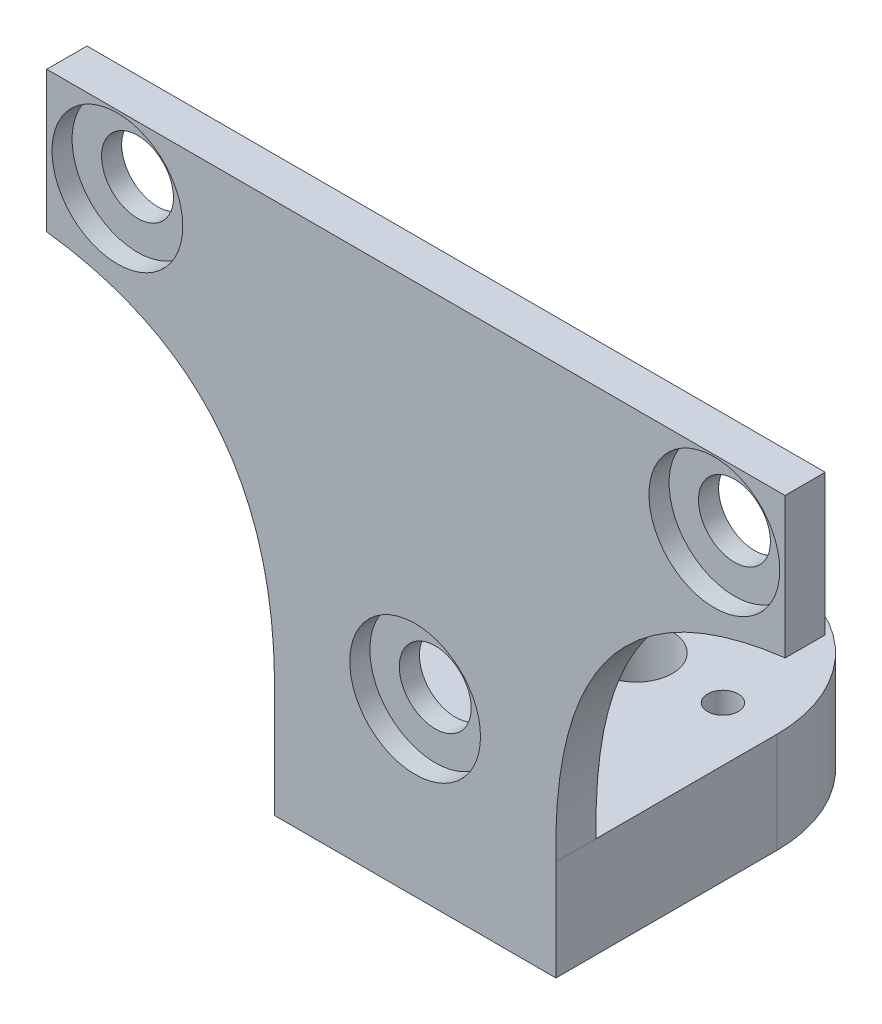
ISO-10303-21;
HEADER;
FILE_DESCRIPTION(('STEP AP214'),'2;1');
FILE_NAME('part.step','',(''),(''),'','','');
FILE_SCHEMA(('AUTOMOTIVE_DESIGN { 1 0 10303 214 1 1 1 1 }'));
ENDSEC;
DATA;
#1=APPLICATION_CONTEXT('core data for automotive mechanical design processes');
#2=APPLICATION_PROTOCOL_DEFINITION('international standard','automotive_design',2000,#1);
#3=PRODUCT_CONTEXT('',#1,'mechanical');
#4=PRODUCT('Part','Part','',(#3));
#5=PRODUCT_RELATED_PRODUCT_CATEGORY('part','',(#4));
#6=PRODUCT_DEFINITION_FORMATION('','',#4);
#7=PRODUCT_DEFINITION_CONTEXT('part definition',#1,'design');
#8=PRODUCT_DEFINITION('design','',#6,#7);
#9=PRODUCT_DEFINITION_SHAPE('','',#8);
#10=(LENGTH_UNIT() NAMED_UNIT(*) SI_UNIT(.MILLI.,.METRE.));
#11=(NAMED_UNIT(*) PLANE_ANGLE_UNIT() SI_UNIT($,.RADIAN.));
#12=(NAMED_UNIT(*) SI_UNIT($,.STERADIAN.) SOLID_ANGLE_UNIT());
#13=UNCERTAINTY_MEASURE_WITH_UNIT(LENGTH_MEASURE(1.E-05),#10,'distance_accuracy_value','');
#14=(GEOMETRIC_REPRESENTATION_CONTEXT(3) GLOBAL_UNCERTAINTY_ASSIGNED_CONTEXT((#13)) GLOBAL_UNIT_ASSIGNED_CONTEXT((#10,
#11,#12)) REPRESENTATION_CONTEXT('',''));
#15=CARTESIAN_POINT('',(0.,0.,0.));
#16=DIRECTION('',(0.,0.,1.));
#17=DIRECTION('',(1.,0.,0.));
#18=AXIS2_PLACEMENT_3D('',#15,#16,#17);
#19=CARTESIAN_POINT('',(36.625,7.025,4.));
#20=DIRECTION('',(0.,0.,-1.));
#21=DIRECTION('',(-1.,0.,0.));
#22=AXIS2_PLACEMENT_3D('',#19,#20,#21);
#23=CYLINDRICAL_SURFACE('',#22,3.575);
#24=CARTESIAN_POINT('',(36.625,7.025,0.));
#25=DIRECTION('',(0.,0.,1.));
#26=DIRECTION('',(1.,0.,0.));
#27=AXIS2_PLACEMENT_3D('',#24,#25,#26);
#28=CIRCLE('',#27,3.575);
#29=CARTESIAN_POINT('',(40.2,7.025,0.));
#30=VERTEX_POINT('',#29);
#31=EDGE_CURVE('E206',#30,#30,#28,.T.);
#32=ORIENTED_EDGE('',*,*,#31,.F.);
#33=EDGE_LOOP('',(#32));
#34=FACE_BOUND('',#33,.T.);
#35=CARTESIAN_POINT('',(36.625,7.025,2.00000000000001));
#36=DIRECTION('',(0.,0.,1.));
#37=DIRECTION('',(1.,0.,0.));
#38=AXIS2_PLACEMENT_3D('',#35,#36,#37);
#39=CIRCLE('',#38,3.575);
#40=CARTESIAN_POINT('',(40.2,7.025,2.00000000000001));
#41=VERTEX_POINT('',#40);
#42=EDGE_CURVE('E240',#41,#41,#39,.T.);
#43=ORIENTED_EDGE('',*,*,#42,.T.);
#44=EDGE_LOOP('',(#43));
#45=FACE_BOUND('',#44,.T.);
#46=ADVANCED_FACE('F33',(#34,#45),#23,.F.);
#47=CARTESIAN_POINT('',(66.375,36.2459201540821,4.));
#48=DIRECTION('',(0.,0.,-1.));
#49=DIRECTION('',(-1.,0.,0.));
#50=AXIS2_PLACEMENT_3D('',#47,#48,#49);
#51=CYLINDRICAL_SURFACE('',#50,3.57499999999999);
#52=CARTESIAN_POINT('',(66.375,36.2459201540821,0.));
#53=DIRECTION('',(0.,0.,1.));
#54=DIRECTION('',(1.,0.,0.));
#55=AXIS2_PLACEMENT_3D('',#52,#53,#54);
#56=CIRCLE('',#55,3.57499999999999);
#57=CARTESIAN_POINT('',(69.95,36.2459201540821,0.));
#58=VERTEX_POINT('',#57);
#59=EDGE_CURVE('E209',#58,#58,#56,.T.);
#60=ORIENTED_EDGE('',*,*,#59,.F.);
#61=EDGE_LOOP('',(#60));
#62=FACE_BOUND('',#61,.T.);
#63=CARTESIAN_POINT('',(66.375,36.2459201540821,2.00000000000001));
#64=DIRECTION('',(0.,0.,1.));
#65=DIRECTION('',(1.,0.,0.));
#66=AXIS2_PLACEMENT_3D('',#63,#64,#65);
#67=CIRCLE('',#66,3.57499999999999);
#68=CARTESIAN_POINT('',(69.95,36.2459201540821,2.00000000000001));
#69=VERTEX_POINT('',#68);
#70=EDGE_CURVE('E196',#69,#69,#67,.T.);
#71=ORIENTED_EDGE('',*,*,#70,.T.);
#72=EDGE_LOOP('',(#71));
#73=FACE_BOUND('',#72,.T.);
#74=ADVANCED_FACE('F161',(#62,#73),#51,.F.);
#75=CARTESIAN_POINT('',(7.025,36.1785252025194,4.));
#76=DIRECTION('',(0.,0.,-1.));
#77=DIRECTION('',(-1.,0.,0.));
#78=AXIS2_PLACEMENT_3D('',#75,#76,#77);
#79=CYLINDRICAL_SURFACE('',#78,3.575);
#80=CARTESIAN_POINT('',(7.025,36.1785252025194,0.));
#81=DIRECTION('',(0.,0.,1.));
#82=DIRECTION('',(1.,0.,0.));
#83=AXIS2_PLACEMENT_3D('',#80,#81,#82);
#84=CIRCLE('',#83,3.575);
#85=CARTESIAN_POINT('',(10.6,36.1785252025194,0.));
#86=VERTEX_POINT('',#85);
#87=EDGE_CURVE('E212',#86,#86,#84,.T.);
#88=ORIENTED_EDGE('',*,*,#87,.F.);
#89=EDGE_LOOP('',(#88));
#90=FACE_BOUND('',#89,.T.);
#91=CARTESIAN_POINT('',(7.025,36.1785252025194,2.00000000000001));
#92=DIRECTION('',(0.,0.,1.));
#93=DIRECTION('',(1.,0.,0.));
#94=AXIS2_PLACEMENT_3D('',#91,#92,#93);
#95=CIRCLE('',#94,3.575);
#96=CARTESIAN_POINT('',(10.6,36.1785252025194,2.00000000000001));
#97=VERTEX_POINT('',#96);
#98=EDGE_CURVE('E199',#97,#97,#95,.T.);
#99=ORIENTED_EDGE('',*,*,#98,.T.);
#100=EDGE_LOOP('',(#99));
#101=FACE_BOUND('',#100,.T.);
#102=ADVANCED_FACE('F167',(#90,#101),#79,.F.);
#103=CARTESIAN_POINT('',(55.9850251873957,20.2441641552591,4.));
#104=DIRECTION('',(0.,0.,-1.));
#105=DIRECTION('',(-1.,0.,0.));
#106=AXIS2_PLACEMENT_3D('',#103,#104,#105);
#107=PLANE('',#106);
#108=CARTESIAN_POINT('',(36.625,7.025,4.));
#109=DIRECTION('',(0.,0.,1.));
#110=DIRECTION('',(1.,0.,0.));
#111=AXIS2_PLACEMENT_3D('',#108,#109,#110);
#112=CIRCLE('',#111,6.5);
#113=CARTESIAN_POINT('',(43.125,7.025,4.));
#114=VERTEX_POINT('',#113);
#115=EDGE_CURVE('E186',#114,#114,#112,.T.);
#116=ORIENTED_EDGE('',*,*,#115,.F.);
#117=EDGE_LOOP('',(#116));
#118=FACE_BOUND('',#117,.T.);
#119=CARTESIAN_POINT('',(66.375,36.2459201540821,4.));
#120=DIRECTION('',(0.,0.,1.));
#121=DIRECTION('',(1.,0.,0.));
#122=AXIS2_PLACEMENT_3D('',#119,#120,#121);
#123=CIRCLE('',#122,6.5);
#124=CARTESIAN_POINT('',(72.875,36.2459201540821,4.));
#125=VERTEX_POINT('',#124);
#126=EDGE_CURVE('E190',#125,#125,#123,.T.);
#127=ORIENTED_EDGE('',*,*,#126,.F.);
#128=EDGE_LOOP('',(#127));
#129=FACE_BOUND('',#128,.T.);
#130=CARTESIAN_POINT('',(7.025,36.1785252025194,4.));
#131=DIRECTION('',(0.,0.,1.));
#132=DIRECTION('',(1.,0.,0.));
#133=AXIS2_PLACEMENT_3D('',#130,#131,#132);
#134=CIRCLE('',#133,6.5);
#135=CARTESIAN_POINT('',(13.525,36.1785252025194,4.));
#136=VERTEX_POINT('',#135);
#137=EDGE_CURVE('E193',#136,#136,#134,.T.);
#138=ORIENTED_EDGE('',*,*,#137,.F.);
#139=EDGE_LOOP('',(#138));
#140=FACE_BOUND('',#139,.T.);
#141=CARTESIAN_POINT('',(50.625,0.,4.));
#142=CARTESIAN_POINT('',(50.0325503747914,26.0221043712902,4.));
#143=CARTESIAN_POINT('',(73.25,28.9324478784558,4.));
#144=B_SPLINE_CURVE_WITH_KNOTS('',2,(#141,#142,#143),.UNSPECIFIED.,.F.,.F.,(3,3),(0.,1.),.UNSPECIFIED.);
#145=CARTESIAN_POINT('',(50.625,0.,4.));
#146=VERTEX_POINT('',#145);
#147=CARTESIAN_POINT('',(73.25,28.9324478784558,4.));
#148=VERTEX_POINT('',#147);
#149=EDGE_CURVE('E53',#146,#148,#144,.T.);
#150=ORIENTED_EDGE('',*,*,#149,.T.);
#151=DIRECTION('',(1.,0.,0.));
#152=VECTOR('',#151,1.);
#153=CARTESIAN_POINT('',(73.25,28.9324478784558,4.));
#154=LINE('',#153,#152);
#155=CARTESIAN_POINT('',(73.4,28.9324478784558,4.));
#156=VERTEX_POINT('',#155);
#157=EDGE_CURVE('E94',#148,#156,#154,.T.);
#158=ORIENTED_EDGE('',*,*,#157,.T.);
#159=DIRECTION('',(0.,1.,0.));
#160=VECTOR('',#159,1.);
#161=CARTESIAN_POINT('',(73.4,42.9324478784558,4.));
#162=LINE('',#161,#160);
#163=CARTESIAN_POINT('',(73.4,42.9324478784558,4.));
#164=VERTEX_POINT('',#163);
#165=EDGE_CURVE('E223',#156,#164,#162,.T.);
#166=ORIENTED_EDGE('',*,*,#165,.T.);
#167=DIRECTION('',(-1.,0.,0.));
#168=VECTOR('',#167,1.);
#169=CARTESIAN_POINT('',(0.,42.9324478784558,4.));
#170=LINE('',#169,#168);
#171=CARTESIAN_POINT('',(0.,42.9324478784558,4.));
#172=VERTEX_POINT('',#171);
#173=EDGE_CURVE('E114',#164,#172,#170,.T.);
#174=ORIENTED_EDGE('',*,*,#173,.T.);
#175=DIRECTION('',(0.,-1.,0.));
#176=VECTOR('',#175,1.);
#177=CARTESIAN_POINT('',(0.,42.9324478784558,4.));
#178=LINE('',#177,#176);
#179=CARTESIAN_POINT('',(0.,28.9324478784558,4.));
#180=VERTEX_POINT('',#179);
#181=EDGE_CURVE('E107',#172,#180,#178,.T.);
#182=ORIENTED_EDGE('',*,*,#181,.T.);
#183=CARTESIAN_POINT('',(0.,28.9324478784558,4.));
#184=CARTESIAN_POINT('',(23.2174496252086,26.0221043712903,4.));
#185=CARTESIAN_POINT('',(22.625,0.,4.));
#186=B_SPLINE_CURVE_WITH_KNOTS('',2,(#183,#184,#185),.UNSPECIFIED.,.F.,.F.,(3,3),(0.,1.),.UNSPECIFIED.);
#187=CARTESIAN_POINT('',(22.625,0.,4.));
#188=VERTEX_POINT('',#187);
#189=EDGE_CURVE('E111',#180,#188,#186,.T.);
#190=ORIENTED_EDGE('',*,*,#189,.T.);
#191=DIRECTION('',(0.,1.,0.));
#192=VECTOR('',#191,1.);
#193=CARTESIAN_POINT('',(22.625,-10.,4.));
#194=LINE('',#193,#192);
#195=CARTESIAN_POINT('',(22.625,-10.,4.));
#196=VERTEX_POINT('',#195);
#197=EDGE_CURVE('E280',#196,#188,#194,.T.);
#198=ORIENTED_EDGE('',*,*,#197,.F.);
#199=DIRECTION('',(-1.,0.,0.));
#200=VECTOR('',#199,1.);
#201=CARTESIAN_POINT('',(22.625,-10.,4.));
#202=LINE('',#201,#200);
#203=CARTESIAN_POINT('',(50.625,-10.,4.));
#204=VERTEX_POINT('',#203);
#205=EDGE_CURVE('E301',#204,#196,#202,.T.);
#206=ORIENTED_EDGE('',*,*,#205,.F.);
#207=DIRECTION('',(0.,1.,0.));
#208=VECTOR('',#207,1.);
#209=CARTESIAN_POINT('',(50.625,-10.,4.));
#210=LINE('',#209,#208);
#211=EDGE_CURVE('E307',#204,#146,#210,.T.);
#212=ORIENTED_EDGE('',*,*,#211,.T.);
#213=EDGE_LOOP('',(#150,#158,#166,#174,#182,#190,#198,#206,#212));
#214=FACE_BOUND('',#213,.T.);
#215=ADVANCED_FACE('F108',(#118,#129,#140,#214),#107,.F.);
#216=CARTESIAN_POINT('',(55.9850251873957,20.2441641552591,0.));
#217=DIRECTION('',(0.,0.,-1.));
#218=DIRECTION('',(-1.,0.,0.));
#219=AXIS2_PLACEMENT_3D('',#216,#217,#218);
#220=PLANE('',#219);
#221=ORIENTED_EDGE('',*,*,#59,.T.);
#222=EDGE_LOOP('',(#221));
#223=FACE_BOUND('',#222,.T.);
#224=CARTESIAN_POINT('',(50.625,0.,0.));
#225=CARTESIAN_POINT('',(50.0325503747914,26.0221043712902,0.));
#226=CARTESIAN_POINT('',(73.25,28.9324478784558,0.));
#227=B_SPLINE_CURVE_WITH_KNOTS('',2,(#224,#225,#226),.UNSPECIFIED.,.F.,.F.,(3,3),(0.,1.),.UNSPECIFIED.);
#228=CARTESIAN_POINT('',(50.625,0.,0.));
#229=VERTEX_POINT('',#228);
#230=CARTESIAN_POINT('',(73.25,28.9324478784558,0.));
#231=VERTEX_POINT('',#230);
#232=EDGE_CURVE('E214',#229,#231,#227,.T.);
#233=ORIENTED_EDGE('',*,*,#232,.F.);
#234=DIRECTION('',(1.,0.,0.));
#235=VECTOR('',#234,1.);
#236=CARTESIAN_POINT('',(36.625,0.,0.));
#237=LINE('',#236,#235);
#238=CARTESIAN_POINT('',(22.625,0.,0.));
#239=VERTEX_POINT('',#238);
#240=EDGE_CURVE('E86',#239,#229,#237,.T.);
#241=ORIENTED_EDGE('',*,*,#240,.F.);
#242=CARTESIAN_POINT('',(0.,28.9324478784558,0.));
#243=CARTESIAN_POINT('',(23.2174496252086,26.0221043712903,0.));
#244=CARTESIAN_POINT('',(22.625,0.,0.));
#245=B_SPLINE_CURVE_WITH_KNOTS('',2,(#242,#243,#244),.UNSPECIFIED.,.F.,.F.,(3,3),(0.,1.),.UNSPECIFIED.);
#246=CARTESIAN_POINT('',(0.,28.9324478784558,0.));
#247=VERTEX_POINT('',#246);
#248=EDGE_CURVE('E256',#247,#239,#245,.T.);
#249=ORIENTED_EDGE('',*,*,#248,.F.);
#250=DIRECTION('',(0.,-1.,0.));
#251=VECTOR('',#250,1.);
#252=CARTESIAN_POINT('',(0.,42.9324478784558,0.));
#253=LINE('',#252,#251);
#254=CARTESIAN_POINT('',(0.,42.9324478784558,0.));
#255=VERTEX_POINT('',#254);
#256=EDGE_CURVE('E78',#255,#247,#253,.T.);
#257=ORIENTED_EDGE('',*,*,#256,.F.);
#258=DIRECTION('',(-1.,0.,0.));
#259=VECTOR('',#258,1.);
#260=CARTESIAN_POINT('',(0.,42.9324478784558,0.));
#261=LINE('',#260,#259);
#262=CARTESIAN_POINT('',(73.4,42.9324478784558,0.));
#263=VERTEX_POINT('',#262);
#264=EDGE_CURVE('E233',#263,#255,#261,.T.);
#265=ORIENTED_EDGE('',*,*,#264,.F.);
#266=DIRECTION('',(0.,1.,0.));
#267=VECTOR('',#266,1.);
#268=CARTESIAN_POINT('',(73.4,42.9324478784558,0.));
#269=LINE('',#268,#267);
#270=CARTESIAN_POINT('',(73.4,28.9324478784558,0.));
#271=VERTEX_POINT('',#270);
#272=EDGE_CURVE('E230',#271,#263,#269,.T.);
#273=ORIENTED_EDGE('',*,*,#272,.F.);
#274=DIRECTION('',(1.,0.,0.));
#275=VECTOR('',#274,1.);
#276=CARTESIAN_POINT('',(73.25,28.9324478784558,0.));
#277=LINE('',#276,#275);
#278=EDGE_CURVE('E134',#231,#271,#277,.T.);
#279=ORIENTED_EDGE('',*,*,#278,.F.);
#280=EDGE_LOOP('',(#233,#241,#249,#257,#265,#273,#279));
#281=FACE_BOUND('',#280,.T.);
#282=ORIENTED_EDGE('',*,*,#87,.T.);
#283=EDGE_LOOP('',(#282));
#284=FACE_BOUND('',#283,.T.);
#285=ORIENTED_EDGE('',*,*,#31,.T.);
#286=EDGE_LOOP('',(#285));
#287=FACE_BOUND('',#286,.T.);
#288=ADVANCED_FACE('F144',(#223,#281,#284,#287),#220,.T.);
#289=DIRECTION('',(0.,0.,-1.));
#290=VECTOR('',#289,1.);
#291=SURFACE_OF_LINEAR_EXTRUSION('',#144,#290);
#292=ORIENTED_EDGE('',*,*,#232,.T.);
#293=DIRECTION('',(0.,0.,-1.));
#294=VECTOR('',#293,1.);
#295=CARTESIAN_POINT('',(73.25,28.9324478784558,4.));
#296=LINE('',#295,#294);
#297=EDGE_CURVE('E11',#148,#231,#296,.T.);
#298=ORIENTED_EDGE('',*,*,#297,.F.);
#299=ORIENTED_EDGE('',*,*,#149,.F.);
#300=DIRECTION('',(0.,0.,-1.));
#301=VECTOR('',#300,1.);
#302=CARTESIAN_POINT('',(50.625,0.,4.));
#303=LINE('',#302,#301);
#304=EDGE_CURVE('E126',#146,#229,#303,.T.);
#305=ORIENTED_EDGE('',*,*,#304,.T.);
#306=EDGE_LOOP('',(#292,#298,#299,#305));
#307=FACE_BOUND('',#306,.T.);
#308=ADVANCED_FACE('F35',(#307),#291,.F.);
#309=CARTESIAN_POINT('',(73.25,28.9324478784558,4.));
#310=DIRECTION('',(0.,1.,0.));
#311=DIRECTION('',(-1.,0.,0.));
#312=AXIS2_PLACEMENT_3D('',#309,#310,#311);
#313=PLANE('',#312);
#314=ORIENTED_EDGE('',*,*,#278,.T.);
#315=DIRECTION('',(0.,0.,-1.));
#316=VECTOR('',#315,1.);
#317=CARTESIAN_POINT('',(73.4,28.9324478784558,4.));
#318=LINE('',#317,#316);
#319=EDGE_CURVE('E44',#156,#271,#318,.T.);
#320=ORIENTED_EDGE('',*,*,#319,.F.);
#321=ORIENTED_EDGE('',*,*,#157,.F.);
#322=ORIENTED_EDGE('',*,*,#297,.T.);
#323=EDGE_LOOP('',(#314,#320,#321,#322));
#324=FACE_BOUND('',#323,.T.);
#325=ADVANCED_FACE('F154',(#324),#313,.F.);
#326=CARTESIAN_POINT('',(73.4,42.9324478784558,4.));
#327=DIRECTION('',(-1.,0.,0.));
#328=DIRECTION('',(0.,0.,1.));
#329=AXIS2_PLACEMENT_3D('',#326,#327,#328);
#330=PLANE('',#329);
#331=ORIENTED_EDGE('',*,*,#272,.T.);
#332=DIRECTION('',(0.,0.,-1.));
#333=VECTOR('',#332,1.);
#334=CARTESIAN_POINT('',(73.4,42.9324478784558,4.));
#335=LINE('',#334,#333);
#336=EDGE_CURVE('E228',#164,#263,#335,.T.);
#337=ORIENTED_EDGE('',*,*,#336,.F.);
#338=ORIENTED_EDGE('',*,*,#165,.F.);
#339=ORIENTED_EDGE('',*,*,#319,.T.);
#340=EDGE_LOOP('',(#331,#337,#338,#339));
#341=FACE_BOUND('',#340,.T.);
#342=ADVANCED_FACE('F151',(#341),#330,.F.);
#343=CARTESIAN_POINT('',(0.,42.9324478784558,4.));
#344=DIRECTION('',(0.,-1.,0.));
#345=DIRECTION('',(0.,0.,-1.));
#346=AXIS2_PLACEMENT_3D('',#343,#344,#345);
#347=PLANE('',#346);
#348=ORIENTED_EDGE('',*,*,#264,.T.);
#349=DIRECTION('',(0.,0.,-1.));
#350=VECTOR('',#349,1.);
#351=CARTESIAN_POINT('',(0.,42.9324478784558,4.));
#352=LINE('',#351,#350);
#353=EDGE_CURVE('E120',#172,#255,#352,.T.);
#354=ORIENTED_EDGE('',*,*,#353,.F.);
#355=ORIENTED_EDGE('',*,*,#173,.F.);
#356=ORIENTED_EDGE('',*,*,#336,.T.);
#357=EDGE_LOOP('',(#348,#354,#355,#356));
#358=FACE_BOUND('',#357,.T.);
#359=ADVANCED_FACE('F148',(#358),#347,.F.);
#360=CARTESIAN_POINT('',(0.,42.9324478784558,4.));
#361=DIRECTION('',(1.,0.,0.));
#362=DIRECTION('',(0.,1.,0.));
#363=AXIS2_PLACEMENT_3D('',#360,#361,#362);
#364=PLANE('',#363);
#365=ORIENTED_EDGE('',*,*,#256,.T.);
#366=DIRECTION('',(0.,0.,-1.));
#367=VECTOR('',#366,1.);
#368=CARTESIAN_POINT('',(0.,28.9324478784558,4.));
#369=LINE('',#368,#367);
#370=EDGE_CURVE('E117',#180,#247,#369,.T.);
#371=ORIENTED_EDGE('',*,*,#370,.F.);
#372=ORIENTED_EDGE('',*,*,#181,.F.);
#373=ORIENTED_EDGE('',*,*,#353,.T.);
#374=EDGE_LOOP('',(#365,#371,#372,#373));
#375=FACE_BOUND('',#374,.T.);
#376=ADVANCED_FACE('F118',(#375),#364,.F.);
#377=DIRECTION('',(0.,0.,-1.));
#378=VECTOR('',#377,1.);
#379=SURFACE_OF_LINEAR_EXTRUSION('',#186,#378);
#380=ORIENTED_EDGE('',*,*,#248,.T.);
#381=DIRECTION('',(0.,0.,-1.));
#382=VECTOR('',#381,1.);
#383=CARTESIAN_POINT('',(22.625,0.,4.));
#384=LINE('',#383,#382);
#385=EDGE_CURVE('E121',#188,#239,#384,.T.);
#386=ORIENTED_EDGE('',*,*,#385,.F.);
#387=ORIENTED_EDGE('',*,*,#189,.F.);
#388=ORIENTED_EDGE('',*,*,#370,.T.);
#389=EDGE_LOOP('',(#380,#386,#387,#388));
#390=FACE_BOUND('',#389,.T.);
#391=ADVANCED_FACE('F123',(#390),#379,.F.);
#392=CARTESIAN_POINT('',(7.025,36.1785252025194,2.00000000000001));
#393=DIRECTION('',(0.,0.,1.));
#394=DIRECTION('',(1.,0.,0.));
#395=AXIS2_PLACEMENT_3D('',#392,#393,#394);
#396=CYLINDRICAL_SURFACE('',#395,6.5);
#397=CARTESIAN_POINT('',(7.025,36.1785252025194,2.00000000000001));
#398=DIRECTION('',(0.,0.,1.));
#399=DIRECTION('',(1.,0.,0.));
#400=AXIS2_PLACEMENT_3D('',#397,#398,#399);
#401=CIRCLE('',#400,6.5);
#402=CARTESIAN_POINT('',(13.525,36.1785252025194,2.00000000000001));
#403=VERTEX_POINT('',#402);
#404=EDGE_CURVE('E195',#403,#403,#401,.T.);
#405=ORIENTED_EDGE('',*,*,#404,.F.);
#406=EDGE_LOOP('',(#405));
#407=FACE_BOUND('',#406,.T.);
#408=ORIENTED_EDGE('',*,*,#137,.T.);
#409=EDGE_LOOP('',(#408));
#410=FACE_BOUND('',#409,.T.);
#411=ADVANCED_FACE('F143',(#407,#410),#396,.F.);
#412=CARTESIAN_POINT('',(7.025,36.1785252025194,2.00000000000001));
#413=DIRECTION('',(0.,0.,1.));
#414=DIRECTION('',(1.,0.,0.));
#415=AXIS2_PLACEMENT_3D('',#412,#413,#414);
#416=PLANE('',#415);
#417=ORIENTED_EDGE('',*,*,#98,.F.);
#418=EDGE_LOOP('',(#417));
#419=FACE_BOUND('',#418,.T.);
#420=ORIENTED_EDGE('',*,*,#404,.T.);
#421=EDGE_LOOP('',(#420));
#422=FACE_BOUND('',#421,.T.);
#423=ADVANCED_FACE('F394',(#419,#422),#416,.T.);
#424=CARTESIAN_POINT('',(66.375,36.2459201540821,2.00000000000001));
#425=DIRECTION('',(0.,0.,1.));
#426=DIRECTION('',(1.,0.,0.));
#427=AXIS2_PLACEMENT_3D('',#424,#425,#426);
#428=CYLINDRICAL_SURFACE('',#427,6.5);
#429=CARTESIAN_POINT('',(66.375,36.2459201540821,2.00000000000001));
#430=DIRECTION('',(0.,0.,1.));
#431=DIRECTION('',(1.,0.,0.));
#432=AXIS2_PLACEMENT_3D('',#429,#430,#431);
#433=CIRCLE('',#432,6.5);
#434=CARTESIAN_POINT('',(72.875,36.2459201540821,2.00000000000001));
#435=VERTEX_POINT('',#434);
#436=EDGE_CURVE('E202',#435,#435,#433,.T.);
#437=ORIENTED_EDGE('',*,*,#436,.F.);
#438=EDGE_LOOP('',(#437));
#439=FACE_BOUND('',#438,.T.);
#440=ORIENTED_EDGE('',*,*,#126,.T.);
#441=EDGE_LOOP('',(#440));
#442=FACE_BOUND('',#441,.T.);
#443=ADVANCED_FACE('F391',(#439,#442),#428,.F.);
#444=CARTESIAN_POINT('',(66.375,36.2459201540821,2.00000000000001));
#445=DIRECTION('',(0.,0.,1.));
#446=DIRECTION('',(1.,0.,0.));
#447=AXIS2_PLACEMENT_3D('',#444,#445,#446);
#448=PLANE('',#447);
#449=ORIENTED_EDGE('',*,*,#70,.F.);
#450=EDGE_LOOP('',(#449));
#451=FACE_BOUND('',#450,.T.);
#452=ORIENTED_EDGE('',*,*,#436,.T.);
#453=EDGE_LOOP('',(#452));
#454=FACE_BOUND('',#453,.T.);
#455=ADVANCED_FACE('F387',(#451,#454),#448,.T.);
#456=CARTESIAN_POINT('',(36.625,7.025,2.00000000000001));
#457=DIRECTION('',(0.,0.,1.));
#458=DIRECTION('',(1.,0.,0.));
#459=AXIS2_PLACEMENT_3D('',#456,#457,#458);
#460=CYLINDRICAL_SURFACE('',#459,6.5);
#461=CARTESIAN_POINT('',(36.625,7.025,2.00000000000001));
#462=DIRECTION('',(0.,0.,1.));
#463=DIRECTION('',(1.,0.,0.));
#464=AXIS2_PLACEMENT_3D('',#461,#462,#463);
#465=CIRCLE('',#464,6.5);
#466=CARTESIAN_POINT('',(43.125,7.025,2.00000000000001));
#467=VERTEX_POINT('',#466);
#468=EDGE_CURVE('E243',#467,#467,#465,.T.);
#469=ORIENTED_EDGE('',*,*,#468,.F.);
#470=EDGE_LOOP('',(#469));
#471=FACE_BOUND('',#470,.T.);
#472=ORIENTED_EDGE('',*,*,#115,.T.);
#473=EDGE_LOOP('',(#472));
#474=FACE_BOUND('',#473,.T.);
#475=ADVANCED_FACE('F383',(#471,#474),#460,.F.);
#476=CARTESIAN_POINT('',(36.625,7.025,2.00000000000001));
#477=DIRECTION('',(0.,0.,1.));
#478=DIRECTION('',(1.,0.,0.));
#479=AXIS2_PLACEMENT_3D('',#476,#477,#478);
#480=PLANE('',#479);
#481=ORIENTED_EDGE('',*,*,#42,.F.);
#482=EDGE_LOOP('',(#481));
#483=FACE_BOUND('',#482,.T.);
#484=ORIENTED_EDGE('',*,*,#468,.T.);
#485=EDGE_LOOP('',(#484));
#486=FACE_BOUND('',#485,.T.);
#487=ADVANCED_FACE('F369',(#483,#486),#480,.T.);
#488=CARTESIAN_POINT('',(36.625,0.,-18.));
#489=DIRECTION('',(0.,-1.,0.));
#490=DIRECTION('',(1.,0.,0.));
#491=AXIS2_PLACEMENT_3D('',#488,#489,#490);
#492=PLANE('',#491);
#493=CARTESIAN_POINT('',(45.225,0.,-18.));
#494=DIRECTION('',(0.,-1.,0.));
#495=DIRECTION('',(1.,0.,0.));
#496=AXIS2_PLACEMENT_3D('',#493,#494,#495);
#497=CIRCLE('',#496,1.525);
#498=CARTESIAN_POINT('',(46.75,0.,-18.));
#499=VERTEX_POINT('',#498);
#500=EDGE_CURVE('E352',#499,#499,#497,.T.);
#501=ORIENTED_EDGE('',*,*,#500,.T.);
#502=EDGE_LOOP('',(#501));
#503=FACE_BOUND('',#502,.T.);
#504=CARTESIAN_POINT('',(36.625,0.,-18.));
#505=DIRECTION('',(0.,-1.,0.));
#506=DIRECTION('',(1.,0.,0.));
#507=AXIS2_PLACEMENT_3D('',#504,#505,#506);
#508=CIRCLE('',#507,3.575);
#509=CARTESIAN_POINT('',(40.2,0.,-18.));
#510=VERTEX_POINT('',#509);
#511=EDGE_CURVE('E340',#510,#510,#508,.T.);
#512=ORIENTED_EDGE('',*,*,#511,.T.);
#513=EDGE_LOOP('',(#512));
#514=FACE_BOUND('',#513,.T.);
#515=CARTESIAN_POINT('',(28.025,0.,-18.));
#516=DIRECTION('',(0.,-1.,0.));
#517=DIRECTION('',(1.,0.,0.));
#518=AXIS2_PLACEMENT_3D('',#515,#516,#517);
#519=CIRCLE('',#518,1.525);
#520=CARTESIAN_POINT('',(29.55,0.,-18.));
#521=VERTEX_POINT('',#520);
#522=EDGE_CURVE('E346',#521,#521,#519,.T.);
#523=ORIENTED_EDGE('',*,*,#522,.T.);
#524=EDGE_LOOP('',(#523));
#525=FACE_BOUND('',#524,.T.);
#526=DIRECTION('',(0.,0.,-1.));
#527=VECTOR('',#526,1.);
#528=CARTESIAN_POINT('',(22.625,0.,-18.));
#529=LINE('',#528,#527);
#530=CARTESIAN_POINT('',(22.625,0.,-18.));
#531=VERTEX_POINT('',#530);
#532=EDGE_CURVE('E266',#239,#531,#529,.T.);
#533=ORIENTED_EDGE('',*,*,#532,.F.);
#534=ORIENTED_EDGE('',*,*,#240,.T.);
#535=DIRECTION('',(0.,0.,1.));
#536=VECTOR('',#535,1.);
#537=CARTESIAN_POINT('',(50.625,0.,-18.));
#538=LINE('',#537,#536);
#539=CARTESIAN_POINT('',(50.625,0.,-18.));
#540=VERTEX_POINT('',#539);
#541=EDGE_CURVE('E299',#540,#229,#538,.T.);
#542=ORIENTED_EDGE('',*,*,#541,.F.);
#543=CARTESIAN_POINT('',(36.625,0.,-18.));
#544=DIRECTION('',(0.,-1.,0.));
#545=DIRECTION('',(1.,0.,0.));
#546=AXIS2_PLACEMENT_3D('',#543,#544,#545);
#547=CIRCLE('',#546,14.);
#548=EDGE_CURVE('E272',#531,#540,#547,.T.);
#549=ORIENTED_EDGE('',*,*,#548,.F.);
#550=EDGE_LOOP('',(#533,#534,#542,#549));
#551=FACE_BOUND('',#550,.T.);
#552=ADVANCED_FACE('F267',(#503,#514,#525,#551),#492,.F.);
#553=CARTESIAN_POINT('',(36.625,-10.,-18.));
#554=DIRECTION('',(0.,-1.,0.));
#555=DIRECTION('',(1.,0.,0.));
#556=AXIS2_PLACEMENT_3D('',#553,#554,#555);
#557=PLANE('',#556);
#558=CARTESIAN_POINT('',(28.025,-10.,-18.));
#559=DIRECTION('',(0.,-1.,0.));
#560=DIRECTION('',(1.,0.,0.));
#561=AXIS2_PLACEMENT_3D('',#558,#559,#560);
#562=CIRCLE('',#561,1.525);
#563=CARTESIAN_POINT('',(29.55,-10.,-18.));
#564=VERTEX_POINT('',#563);
#565=EDGE_CURVE('E343',#564,#564,#562,.T.);
#566=ORIENTED_EDGE('',*,*,#565,.F.);
#567=EDGE_LOOP('',(#566));
#568=FACE_BOUND('',#567,.T.);
#569=ORIENTED_EDGE('',*,*,#205,.T.);
#570=DIRECTION('',(0.,0.,-1.));
#571=VECTOR('',#570,1.);
#572=CARTESIAN_POINT('',(22.625,-10.,-18.));
#573=LINE('',#572,#571);
#574=CARTESIAN_POINT('',(22.625,-10.,-18.));
#575=VERTEX_POINT('',#574);
#576=EDGE_CURVE('E289',#196,#575,#573,.T.);
#577=ORIENTED_EDGE('',*,*,#576,.T.);
#578=CARTESIAN_POINT('',(36.625,-10.,-18.));
#579=DIRECTION('',(0.,-1.,0.));
#580=DIRECTION('',(1.,0.,0.));
#581=AXIS2_PLACEMENT_3D('',#578,#579,#580);
#582=CIRCLE('',#581,14.);
#583=CARTESIAN_POINT('',(50.625,-10.,-18.));
#584=VERTEX_POINT('',#583);
#585=EDGE_CURVE('E324',#575,#584,#582,.T.);
#586=ORIENTED_EDGE('',*,*,#585,.T.);
#587=DIRECTION('',(0.,0.,1.));
#588=VECTOR('',#587,1.);
#589=CARTESIAN_POINT('',(50.625,-10.,-18.));
#590=LINE('',#589,#588);
#591=EDGE_CURVE('E309',#584,#204,#590,.T.);
#592=ORIENTED_EDGE('',*,*,#591,.T.);
#593=EDGE_LOOP('',(#569,#577,#586,#592));
#594=FACE_BOUND('',#593,.T.);
#595=CARTESIAN_POINT('',(36.625,-10.,-18.));
#596=DIRECTION('',(0.,-1.,0.));
#597=DIRECTION('',(1.,0.,0.));
#598=AXIS2_PLACEMENT_3D('',#595,#596,#597);
#599=CIRCLE('',#598,3.575);
#600=CARTESIAN_POINT('',(40.2,-10.,-18.));
#601=VERTEX_POINT('',#600);
#602=EDGE_CURVE('E276',#601,#601,#599,.T.);
#603=ORIENTED_EDGE('',*,*,#602,.F.);
#604=EDGE_LOOP('',(#603));
#605=FACE_BOUND('',#604,.T.);
#606=CARTESIAN_POINT('',(45.225,-10.,-18.));
#607=DIRECTION('',(0.,-1.,0.));
#608=DIRECTION('',(1.,0.,0.));
#609=AXIS2_PLACEMENT_3D('',#606,#607,#608);
#610=CIRCLE('',#609,1.525);
#611=CARTESIAN_POINT('',(46.75,-10.,-18.));
#612=VERTEX_POINT('',#611);
#613=EDGE_CURVE('E349',#612,#612,#610,.T.);
#614=ORIENTED_EDGE('',*,*,#613,.F.);
#615=EDGE_LOOP('',(#614));
#616=FACE_BOUND('',#615,.T.);
#617=ADVANCED_FACE('F332',(#568,#594,#605,#616),#557,.T.);
#618=CARTESIAN_POINT('',(22.625,-10.,-18.));
#619=DIRECTION('',(1.,0.,0.));
#620=DIRECTION('',(0.,0.,-1.));
#621=AXIS2_PLACEMENT_3D('',#618,#619,#620);
#622=PLANE('',#621);
#623=ORIENTED_EDGE('',*,*,#385,.T.);
#624=ORIENTED_EDGE('',*,*,#532,.T.);
#625=DIRECTION('',(0.,1.,0.));
#626=VECTOR('',#625,1.);
#627=CARTESIAN_POINT('',(22.625,-10.,-18.));
#628=LINE('',#627,#626);
#629=EDGE_CURVE('E292',#575,#531,#628,.T.);
#630=ORIENTED_EDGE('',*,*,#629,.F.);
#631=ORIENTED_EDGE('',*,*,#576,.F.);
#632=ORIENTED_EDGE('',*,*,#197,.T.);
#633=EDGE_LOOP('',(#623,#624,#630,#631,#632));
#634=FACE_BOUND('',#633,.T.);
#635=ADVANCED_FACE('F278',(#634),#622,.F.);
#636=CARTESIAN_POINT('',(36.625,-10.,-18.));
#637=DIRECTION('',(0.,1.,0.));
#638=DIRECTION('',(-1.,0.,0.));
#639=AXIS2_PLACEMENT_3D('',#636,#637,#638);
#640=CYLINDRICAL_SURFACE('',#639,14.);
#641=ORIENTED_EDGE('',*,*,#548,.T.);
#642=DIRECTION('',(0.,1.,0.));
#643=VECTOR('',#642,1.);
#644=CARTESIAN_POINT('',(50.625,-10.,-18.));
#645=LINE('',#644,#643);
#646=EDGE_CURVE('E295',#584,#540,#645,.T.);
#647=ORIENTED_EDGE('',*,*,#646,.F.);
#648=ORIENTED_EDGE('',*,*,#585,.F.);
#649=ORIENTED_EDGE('',*,*,#629,.T.);
#650=EDGE_LOOP('',(#641,#647,#648,#649));
#651=FACE_BOUND('',#650,.T.);
#652=ADVANCED_FACE('F321',(#651),#640,.T.);
#653=CARTESIAN_POINT('',(50.625,-10.,-18.));
#654=DIRECTION('',(-1.,0.,0.));
#655=DIRECTION('',(0.,-1.,0.));
#656=AXIS2_PLACEMENT_3D('',#653,#654,#655);
#657=PLANE('',#656);
#658=ORIENTED_EDGE('',*,*,#541,.T.);
#659=ORIENTED_EDGE('',*,*,#304,.F.);
#660=ORIENTED_EDGE('',*,*,#211,.F.);
#661=ORIENTED_EDGE('',*,*,#591,.F.);
#662=ORIENTED_EDGE('',*,*,#646,.T.);
#663=EDGE_LOOP('',(#658,#659,#660,#661,#662));
#664=FACE_BOUND('',#663,.T.);
#665=ADVANCED_FACE('F315',(#664),#657,.F.);
#666=CARTESIAN_POINT('',(36.625,-10.,-18.));
#667=DIRECTION('',(0.,1.,0.));
#668=DIRECTION('',(-1.,0.,0.));
#669=AXIS2_PLACEMENT_3D('',#666,#667,#668);
#670=CYLINDRICAL_SURFACE('',#669,3.575);
#671=ORIENTED_EDGE('',*,*,#602,.T.);
#672=EDGE_LOOP('',(#671));
#673=FACE_BOUND('',#672,.T.);
#674=ORIENTED_EDGE('',*,*,#511,.F.);
#675=EDGE_LOOP('',(#674));
#676=FACE_BOUND('',#675,.T.);
#677=ADVANCED_FACE('F374',(#673,#676),#670,.F.);
#678=CARTESIAN_POINT('',(28.025,-10.,-18.));
#679=DIRECTION('',(0.,1.,0.));
#680=DIRECTION('',(-1.,0.,0.));
#681=AXIS2_PLACEMENT_3D('',#678,#679,#680);
#682=CYLINDRICAL_SURFACE('',#681,1.525);
#683=ORIENTED_EDGE('',*,*,#565,.T.);
#684=EDGE_LOOP('',(#683));
#685=FACE_BOUND('',#684,.T.);
#686=ORIENTED_EDGE('',*,*,#522,.F.);
#687=EDGE_LOOP('',(#686));
#688=FACE_BOUND('',#687,.T.);
#689=ADVANCED_FACE('F485',(#685,#688),#682,.F.);
#690=CARTESIAN_POINT('',(45.225,-10.,-18.));
#691=DIRECTION('',(0.,1.,0.));
#692=DIRECTION('',(-1.,0.,0.));
#693=AXIS2_PLACEMENT_3D('',#690,#691,#692);
#694=CYLINDRICAL_SURFACE('',#693,1.525);
#695=ORIENTED_EDGE('',*,*,#613,.T.);
#696=EDGE_LOOP('',(#695));
#697=FACE_BOUND('',#696,.T.);
#698=ORIENTED_EDGE('',*,*,#500,.F.);
#699=EDGE_LOOP('',(#698));
#700=FACE_BOUND('',#699,.T.);
#701=ADVANCED_FACE('F358',(#697,#700),#694,.F.);
#702=CLOSED_SHELL('',(#46,#74,#102,#215,#288,#308,#325,#342,#359,#376,#391,#411,#423,#443,#455,
#475,#487,#552,#617,#635,#652,#665,#677,#689,#701));
#703=MANIFOLD_SOLID_BREP('B2',#702);
#704=ADVANCED_BREP_SHAPE_REPRESENTATION('',(#18,#703),#14);
#705=SHAPE_DEFINITION_REPRESENTATION(#9,#704);
ENDSEC;
END-ISO-10303-21;
